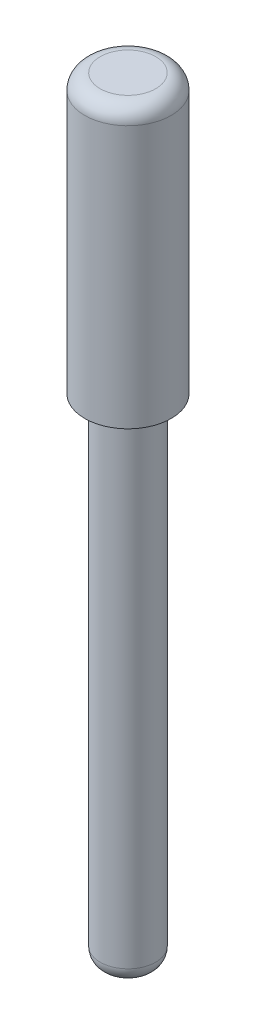
ISO-10303-21;
HEADER;
FILE_DESCRIPTION(('STEP AP214'),'2;1');
FILE_NAME('part.step','',(''),(''),'','','');
FILE_SCHEMA(('AUTOMOTIVE_DESIGN { 1 0 10303 214 1 1 1 1 }'));
ENDSEC;
DATA;
#1=APPLICATION_CONTEXT('core data for automotive mechanical design processes');
#2=APPLICATION_PROTOCOL_DEFINITION('international standard','automotive_design',2000,#1);
#3=PRODUCT_CONTEXT('',#1,'mechanical');
#4=PRODUCT('Part','Part','',(#3));
#5=PRODUCT_RELATED_PRODUCT_CATEGORY('part','',(#4));
#6=PRODUCT_DEFINITION_FORMATION('','',#4);
#7=PRODUCT_DEFINITION_CONTEXT('part definition',#1,'design');
#8=PRODUCT_DEFINITION('design','',#6,#7);
#9=PRODUCT_DEFINITION_SHAPE('','',#8);
#10=(LENGTH_UNIT() NAMED_UNIT(*) SI_UNIT(.MILLI.,.METRE.));
#11=(NAMED_UNIT(*) PLANE_ANGLE_UNIT() SI_UNIT($,.RADIAN.));
#12=(NAMED_UNIT(*) SI_UNIT($,.STERADIAN.) SOLID_ANGLE_UNIT());
#13=UNCERTAINTY_MEASURE_WITH_UNIT(LENGTH_MEASURE(1.E-05),#10,'distance_accuracy_value','');
#14=(GEOMETRIC_REPRESENTATION_CONTEXT(3) GLOBAL_UNCERTAINTY_ASSIGNED_CONTEXT((#13)) GLOBAL_UNIT_ASSIGNED_CONTEXT((#10,
#11,#12)) REPRESENTATION_CONTEXT('',''));
#15=CARTESIAN_POINT('',(0.,0.,0.));
#16=DIRECTION('',(0.,0.,1.));
#17=DIRECTION('',(1.,0.,0.));
#18=AXIS2_PLACEMENT_3D('',#15,#16,#17);
#19=CARTESIAN_POINT('',(0.,25.,0.));
#20=DIRECTION('',(0.,-1.,0.));
#21=DIRECTION('',(0.,0.,-1.));
#22=AXIS2_PLACEMENT_3D('',#19,#20,#21);
#23=CYLINDRICAL_SURFACE('',#22,1.4);
#24=CARTESIAN_POINT('',(0.,24.5,0.));
#25=DIRECTION('',(0.,1.,0.));
#26=DIRECTION('',(0.,0.,1.));
#27=AXIS2_PLACEMENT_3D('',#24,#25,#26);
#28=CIRCLE('',#27,1.4);
#29=CARTESIAN_POINT('',(0.,24.5,1.4));
#30=VERTEX_POINT('',#29);
#31=EDGE_CURVE('E10',#30,#30,#28,.F.);
#32=ORIENTED_EDGE('',*,*,#31,.T.);
#33=EDGE_LOOP('',(#32));
#34=FACE_BOUND('',#33,.T.);
#35=CARTESIAN_POINT('',(0.,16.,0.));
#36=DIRECTION('',(0.,1.,0.));
#37=DIRECTION('',(0.,0.,1.));
#38=AXIS2_PLACEMENT_3D('',#35,#36,#37);
#39=CIRCLE('',#38,1.4);
#40=CARTESIAN_POINT('',(0.,16.,1.4));
#41=VERTEX_POINT('',#40);
#42=EDGE_CURVE('E53',#41,#41,#39,.T.);
#43=ORIENTED_EDGE('',*,*,#42,.T.);
#44=EDGE_LOOP('',(#43));
#45=FACE_BOUND('',#44,.T.);
#46=ADVANCED_FACE('F33',(#34,#45),#23,.T.);
#47=CARTESIAN_POINT('',(0.,25.,0.));
#48=DIRECTION('',(0.,1.,0.));
#49=DIRECTION('',(0.,0.,1.));
#50=AXIS2_PLACEMENT_3D('',#47,#48,#49);
#51=PLANE('',#50);
#52=CARTESIAN_POINT('',(0.,25.,0.));
#53=DIRECTION('',(0.,1.,0.));
#54=DIRECTION('',(0.,0.,1.));
#55=AXIS2_PLACEMENT_3D('',#52,#53,#54);
#56=CIRCLE('',#55,0.9);
#57=CARTESIAN_POINT('',(0.,25.,0.9));
#58=VERTEX_POINT('',#57);
#59=EDGE_CURVE('E40',#58,#58,#56,.T.);
#60=ORIENTED_EDGE('',*,*,#59,.T.);
#61=EDGE_LOOP('',(#60));
#62=FACE_BOUND('',#61,.T.);
#63=ADVANCED_FACE('F75',(#62),#51,.T.);
#64=CARTESIAN_POINT('',(0.,16.,-1.4));
#65=DIRECTION('',(0.,-1.,0.));
#66=DIRECTION('',(0.,0.,-1.));
#67=AXIS2_PLACEMENT_3D('',#64,#65,#66);
#68=PLANE('',#67);
#69=CARTESIAN_POINT('',(0.,16.,0.));
#70=DIRECTION('',(0.,1.,0.));
#71=DIRECTION('',(0.,0.,1.));
#72=AXIS2_PLACEMENT_3D('',#69,#70,#71);
#73=CIRCLE('',#72,0.9);
#74=CARTESIAN_POINT('',(0.,16.,0.9));
#75=VERTEX_POINT('',#74);
#76=EDGE_CURVE('E56',#75,#75,#73,.T.);
#77=ORIENTED_EDGE('',*,*,#76,.T.);
#78=EDGE_LOOP('',(#77));
#79=FACE_BOUND('',#78,.T.);
#80=ORIENTED_EDGE('',*,*,#42,.F.);
#81=EDGE_LOOP('',(#80));
#82=FACE_BOUND('',#81,.T.);
#83=ADVANCED_FACE('F60',(#79,#82),#68,.T.);
#84=CARTESIAN_POINT('',(0.,0.,0.));
#85=DIRECTION('',(0.,1.,0.));
#86=DIRECTION('',(0.,0.,1.));
#87=AXIS2_PLACEMENT_3D('',#84,#85,#86);
#88=CYLINDRICAL_SURFACE('',#87,0.9);
#89=CARTESIAN_POINT('',(0.,0.5,0.));
#90=DIRECTION('',(0.,1.,0.));
#91=DIRECTION('',(0.,0.,1.));
#92=AXIS2_PLACEMENT_3D('',#89,#90,#91);
#93=CIRCLE('',#92,0.9);
#94=CARTESIAN_POINT('',(0.,0.5,0.9));
#95=VERTEX_POINT('',#94);
#96=EDGE_CURVE('E48',#95,#95,#93,.T.);
#97=ORIENTED_EDGE('',*,*,#96,.T.);
#98=EDGE_LOOP('',(#97));
#99=FACE_BOUND('',#98,.T.);
#100=ORIENTED_EDGE('',*,*,#76,.F.);
#101=EDGE_LOOP('',(#100));
#102=FACE_BOUND('',#101,.T.);
#103=ADVANCED_FACE('F63',(#99,#102),#88,.T.);
#104=CARTESIAN_POINT('',(0.,0.,0.));
#105=DIRECTION('',(0.,1.,0.));
#106=DIRECTION('',(0.,0.,1.));
#107=AXIS2_PLACEMENT_3D('',#104,#105,#106);
#108=PLANE('',#107);
#109=CARTESIAN_POINT('',(0.,0.,0.));
#110=DIRECTION('',(0.,1.,0.));
#111=DIRECTION('',(0.,0.,1.));
#112=AXIS2_PLACEMENT_3D('',#109,#110,#111);
#113=CIRCLE('',#112,0.4);
#114=CARTESIAN_POINT('',(0.,0.,0.4));
#115=VERTEX_POINT('',#114);
#116=EDGE_CURVE('E44',#115,#115,#113,.F.);
#117=ORIENTED_EDGE('',*,*,#116,.T.);
#118=EDGE_LOOP('',(#117));
#119=FACE_BOUND('',#118,.T.);
#120=ADVANCED_FACE('F65',(#119),#108,.F.);
#121=CARTESIAN_POINT('',(0.,0.5,0.));
#122=DIRECTION('',(0.,1.,0.));
#123=DIRECTION('',(0.,0.,1.));
#124=AXIS2_PLACEMENT_3D('',#121,#122,#123);
#125=DEGENERATE_TOROIDAL_SURFACE('',#124,0.4,0.5,.T.);
#126=ORIENTED_EDGE('',*,*,#116,.F.);
#127=EDGE_LOOP('',(#126));
#128=FACE_BOUND('',#127,.T.);
#129=ORIENTED_EDGE('',*,*,#96,.F.);
#130=EDGE_LOOP('',(#129));
#131=FACE_BOUND('',#130,.T.);
#132=ADVANCED_FACE('F72',(#128,#131),#125,.T.);
#133=CARTESIAN_POINT('',(0.,24.5,0.));
#134=DIRECTION('',(0.,1.,0.));
#135=DIRECTION('',(0.,0.,1.));
#136=AXIS2_PLACEMENT_3D('',#133,#134,#135);
#137=TOROIDAL_SURFACE('',#136,0.9,0.5);
#138=ORIENTED_EDGE('',*,*,#31,.F.);
#139=EDGE_LOOP('',(#138));
#140=FACE_BOUND('',#139,.T.);
#141=ORIENTED_EDGE('',*,*,#59,.F.);
#142=EDGE_LOOP('',(#141));
#143=FACE_BOUND('',#142,.T.);
#144=ADVANCED_FACE('F35',(#140,#143),#137,.T.);
#145=CLOSED_SHELL('',(#46,#63,#83,#103,#120,#132,#144));
#146=MANIFOLD_SOLID_BREP('B2',#145);
#147=ADVANCED_BREP_SHAPE_REPRESENTATION('',(#18,#146),#14);
#148=SHAPE_DEFINITION_REPRESENTATION(#9,#147);
ENDSEC;
END-ISO-10303-21;
